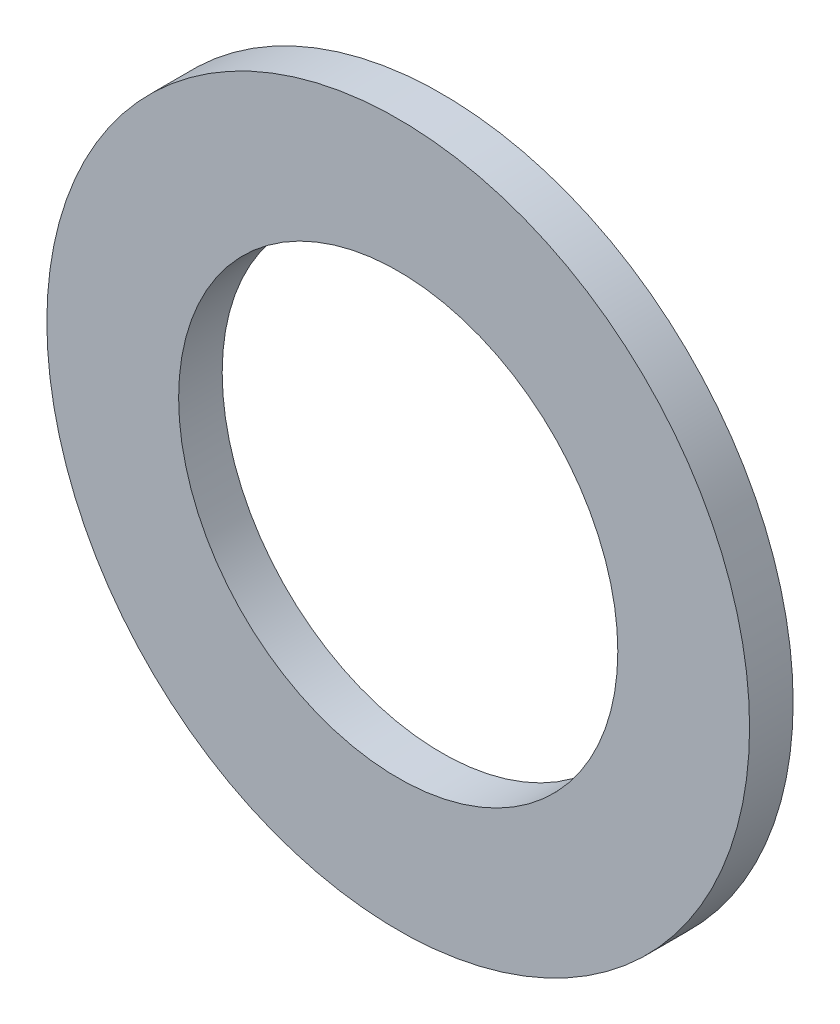
ISO-10303-21;
HEADER;
FILE_DESCRIPTION(('STEP AP214'),'2;1');
FILE_NAME('part.step','',(''),(''),'','','');
FILE_SCHEMA(('AUTOMOTIVE_DESIGN { 1 0 10303 214 1 1 1 1 }'));
ENDSEC;
DATA;
#1=APPLICATION_CONTEXT('core data for automotive mechanical design processes');
#2=APPLICATION_PROTOCOL_DEFINITION('international standard','automotive_design',2000,#1);
#3=PRODUCT_CONTEXT('',#1,'mechanical');
#4=PRODUCT('Part','Part','',(#3));
#5=PRODUCT_RELATED_PRODUCT_CATEGORY('part','',(#4));
#6=PRODUCT_DEFINITION_FORMATION('','',#4);
#7=PRODUCT_DEFINITION_CONTEXT('part definition',#1,'design');
#8=PRODUCT_DEFINITION('design','',#6,#7);
#9=PRODUCT_DEFINITION_SHAPE('','',#8);
#10=(LENGTH_UNIT() NAMED_UNIT(*) SI_UNIT(.MILLI.,.METRE.));
#11=(NAMED_UNIT(*) PLANE_ANGLE_UNIT() SI_UNIT($,.RADIAN.));
#12=(NAMED_UNIT(*) SI_UNIT($,.STERADIAN.) SOLID_ANGLE_UNIT());
#13=UNCERTAINTY_MEASURE_WITH_UNIT(LENGTH_MEASURE(1.E-05),#10,'distance_accuracy_value','');
#14=(GEOMETRIC_REPRESENTATION_CONTEXT(3) GLOBAL_UNCERTAINTY_ASSIGNED_CONTEXT((#13)) GLOBAL_UNIT_ASSIGNED_CONTEXT((#10,
#11,#12)) REPRESENTATION_CONTEXT('',''));
#15=CARTESIAN_POINT('',(0.,0.,0.));
#16=DIRECTION('',(0.,0.,1.));
#17=DIRECTION('',(1.,0.,0.));
#18=AXIS2_PLACEMENT_3D('',#15,#16,#17);
#19=CARTESIAN_POINT('',(0.,0.,1.5748));
#20=DIRECTION('',(0.,0.,1.));
#21=DIRECTION('',(1.,0.,0.));
#22=AXIS2_PLACEMENT_3D('',#19,#20,#21);
#23=PLANE('',#22);
#24=CARTESIAN_POINT('',(0.,0.,1.5748));
#25=DIRECTION('',(0.,0.,1.));
#26=DIRECTION('',(1.,0.,0.));
#27=AXIS2_PLACEMENT_3D('',#24,#25,#26);
#28=CIRCLE('',#27,12.7);
#29=CARTESIAN_POINT('',(12.7,0.,1.5748));
#30=VERTEX_POINT('',#29);
#31=EDGE_CURVE('E10',#30,#30,#28,.T.);
#32=ORIENTED_EDGE('',*,*,#31,.T.);
#33=EDGE_LOOP('',(#32));
#34=FACE_BOUND('',#33,.T.);
#35=CARTESIAN_POINT('',(0.,0.,1.5748));
#36=DIRECTION('',(0.,0.,1.));
#37=DIRECTION('',(1.,0.,0.));
#38=AXIS2_PLACEMENT_3D('',#35,#36,#37);
#39=CIRCLE('',#38,7.9375);
#40=CARTESIAN_POINT('',(7.9375,0.,1.5748));
#41=VERTEX_POINT('',#40);
#42=EDGE_CURVE('E41',#41,#41,#39,.T.);
#43=ORIENTED_EDGE('',*,*,#42,.F.);
#44=EDGE_LOOP('',(#43));
#45=FACE_BOUND('',#44,.T.);
#46=ADVANCED_FACE('F30',(#34,#45),#23,.T.);
#47=CARTESIAN_POINT('',(0.,0.,0.));
#48=DIRECTION('',(0.,0.,1.));
#49=DIRECTION('',(1.,0.,0.));
#50=AXIS2_PLACEMENT_3D('',#47,#48,#49);
#51=PLANE('',#50);
#52=CARTESIAN_POINT('',(0.,0.,0.));
#53=DIRECTION('',(0.,0.,1.));
#54=DIRECTION('',(1.,0.,0.));
#55=AXIS2_PLACEMENT_3D('',#52,#53,#54);
#56=CIRCLE('',#55,12.7);
#57=CARTESIAN_POINT('',(12.7,0.,0.));
#58=VERTEX_POINT('',#57);
#59=EDGE_CURVE('E34',#58,#58,#56,.T.);
#60=ORIENTED_EDGE('',*,*,#59,.F.);
#61=EDGE_LOOP('',(#60));
#62=FACE_BOUND('',#61,.T.);
#63=CARTESIAN_POINT('',(0.,0.,0.));
#64=DIRECTION('',(0.,0.,1.));
#65=DIRECTION('',(1.,0.,0.));
#66=AXIS2_PLACEMENT_3D('',#63,#64,#65);
#67=CIRCLE('',#66,7.9375);
#68=CARTESIAN_POINT('',(7.9375,0.,0.));
#69=VERTEX_POINT('',#68);
#70=EDGE_CURVE('E43',#69,#69,#67,.T.);
#71=ORIENTED_EDGE('',*,*,#70,.T.);
#72=EDGE_LOOP('',(#71));
#73=FACE_BOUND('',#72,.T.);
#74=ADVANCED_FACE('F53',(#62,#73),#51,.F.);
#75=CARTESIAN_POINT('',(0.,0.,1.5748));
#76=DIRECTION('',(0.,0.,-1.));
#77=DIRECTION('',(-1.,0.,0.));
#78=AXIS2_PLACEMENT_3D('',#75,#76,#77);
#79=CYLINDRICAL_SURFACE('',#78,12.7);
#80=ORIENTED_EDGE('',*,*,#31,.F.);
#81=EDGE_LOOP('',(#80));
#82=FACE_BOUND('',#81,.T.);
#83=ORIENTED_EDGE('',*,*,#59,.T.);
#84=EDGE_LOOP('',(#83));
#85=FACE_BOUND('',#84,.T.);
#86=ADVANCED_FACE('F32',(#82,#85),#79,.T.);
#87=CARTESIAN_POINT('',(0.,0.,1.5748));
#88=DIRECTION('',(0.,0.,-1.));
#89=DIRECTION('',(-1.,0.,0.));
#90=AXIS2_PLACEMENT_3D('',#87,#88,#89);
#91=CYLINDRICAL_SURFACE('',#90,7.9375);
#92=ORIENTED_EDGE('',*,*,#42,.T.);
#93=EDGE_LOOP('',(#92));
#94=FACE_BOUND('',#93,.T.);
#95=ORIENTED_EDGE('',*,*,#70,.F.);
#96=EDGE_LOOP('',(#95));
#97=FACE_BOUND('',#96,.T.);
#98=ADVANCED_FACE('F49',(#94,#97),#91,.F.);
#99=CLOSED_SHELL('',(#46,#74,#86,#98));
#100=MANIFOLD_SOLID_BREP('B2',#99);
#101=ADVANCED_BREP_SHAPE_REPRESENTATION('',(#18,#100),#14);
#102=SHAPE_DEFINITION_REPRESENTATION(#9,#101);
ENDSEC;
END-ISO-10303-21;
